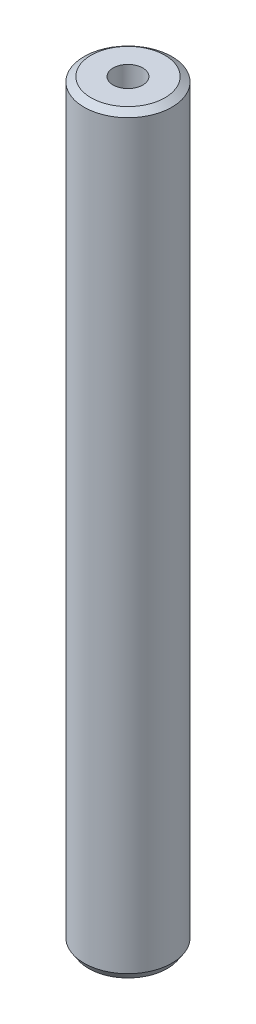
ISO-10303-21;
HEADER;
FILE_DESCRIPTION(('STEP AP214'),'2;1');
FILE_NAME('part.step','',(''),(''),'','','');
FILE_SCHEMA(('AUTOMOTIVE_DESIGN { 1 0 10303 214 1 1 1 1 }'));
ENDSEC;
DATA;
#1=APPLICATION_CONTEXT('core data for automotive mechanical design processes');
#2=APPLICATION_PROTOCOL_DEFINITION('international standard','automotive_design',2000,#1);
#3=PRODUCT_CONTEXT('',#1,'mechanical');
#4=PRODUCT('Part','Part','',(#3));
#5=PRODUCT_RELATED_PRODUCT_CATEGORY('part','',(#4));
#6=PRODUCT_DEFINITION_FORMATION('','',#4);
#7=PRODUCT_DEFINITION_CONTEXT('part definition',#1,'design');
#8=PRODUCT_DEFINITION('design','',#6,#7);
#9=PRODUCT_DEFINITION_SHAPE('','',#8);
#10=(LENGTH_UNIT() NAMED_UNIT(*) SI_UNIT(.MILLI.,.METRE.));
#11=(NAMED_UNIT(*) PLANE_ANGLE_UNIT() SI_UNIT($,.RADIAN.));
#12=(NAMED_UNIT(*) SI_UNIT($,.STERADIAN.) SOLID_ANGLE_UNIT());
#13=UNCERTAINTY_MEASURE_WITH_UNIT(LENGTH_MEASURE(1.E-05),#10,'distance_accuracy_value','');
#14=(GEOMETRIC_REPRESENTATION_CONTEXT(3) GLOBAL_UNCERTAINTY_ASSIGNED_CONTEXT((#13)) GLOBAL_UNIT_ASSIGNED_CONTEXT((#10,
#11,#12)) REPRESENTATION_CONTEXT('',''));
#15=CARTESIAN_POINT('',(0.,0.,0.));
#16=DIRECTION('',(0.,0.,1.));
#17=DIRECTION('',(1.,0.,0.));
#18=AXIS2_PLACEMENT_3D('',#15,#16,#17);
#19=CARTESIAN_POINT('',(0.,600.,0.));
#20=DIRECTION('',(0.,-1.,0.));
#21=DIRECTION('',(0.,0.,-1.));
#22=AXIS2_PLACEMENT_3D('',#19,#20,#21);
#23=CYLINDRICAL_SURFACE('',#22,35.);
#24=CARTESIAN_POINT('',(0.,596.298389018072,0.));
#25=DIRECTION('',(0.,1.,0.));
#26=DIRECTION('',(0.,0.,1.));
#27=AXIS2_PLACEMENT_3D('',#24,#25,#26);
#28=CIRCLE('',#27,35.);
#29=CARTESIAN_POINT('',(0.,596.298389018072,35.));
#30=VERTEX_POINT('',#29);
#31=EDGE_CURVE('E50',#30,#30,#28,.F.);
#32=ORIENTED_EDGE('',*,*,#31,.T.);
#33=EDGE_LOOP('',(#32));
#34=FACE_BOUND('',#33,.T.);
#35=CARTESIAN_POINT('',(0.,5.58968108519553,0.));
#36=DIRECTION('',(0.,1.,0.));
#37=DIRECTION('',(0.,0.,1.));
#38=AXIS2_PLACEMENT_3D('',#35,#36,#37);
#39=CIRCLE('',#38,35.);
#40=CARTESIAN_POINT('',(0.,5.58968108519553,35.));
#41=VERTEX_POINT('',#40);
#42=EDGE_CURVE('E51',#41,#41,#39,.T.);
#43=ORIENTED_EDGE('',*,*,#42,.T.);
#44=EDGE_LOOP('',(#43));
#45=FACE_BOUND('',#44,.T.);
#46=ADVANCED_FACE('F39',(#34,#45),#23,.T.);
#47=CARTESIAN_POINT('',(0.,600.,0.));
#48=DIRECTION('',(0.,1.,0.));
#49=DIRECTION('',(0.,0.,1.));
#50=AXIS2_PLACEMENT_3D('',#47,#48,#49);
#51=PLANE('',#50);
#52=CARTESIAN_POINT('',(0.,600.,0.));
#53=DIRECTION('',(0.,1.,0.));
#54=DIRECTION('',(0.,0.,1.));
#55=AXIS2_PLACEMENT_3D('',#52,#53,#54);
#56=CIRCLE('',#55,29.4103189148042);
#57=CARTESIAN_POINT('',(0.,600.,29.4103189148042));
#58=VERTEX_POINT('',#57);
#59=EDGE_CURVE('E54',#58,#58,#56,.T.);
#60=ORIENTED_EDGE('',*,*,#59,.T.);
#61=EDGE_LOOP('',(#60));
#62=FACE_BOUND('',#61,.T.);
#63=CARTESIAN_POINT('',(0.,600.,0.));
#64=DIRECTION('',(0.,1.,0.));
#65=DIRECTION('',(0.,0.,1.));
#66=AXIS2_PLACEMENT_3D('',#63,#64,#65);
#67=CIRCLE('',#66,11.8149842613026);
#68=CARTESIAN_POINT('',(0.,600.,11.8149842613026));
#69=VERTEX_POINT('',#68);
#70=EDGE_CURVE('E58',#69,#69,#67,.T.);
#71=ORIENTED_EDGE('',*,*,#70,.F.);
#72=EDGE_LOOP('',(#71));
#73=FACE_BOUND('',#72,.T.);
#74=ADVANCED_FACE('F69',(#62,#73),#51,.T.);
#75=CARTESIAN_POINT('',(0.,0.,0.));
#76=DIRECTION('',(0.,1.,0.));
#77=DIRECTION('',(0.,0.,1.));
#78=AXIS2_PLACEMENT_3D('',#75,#76,#77);
#79=PLANE('',#78);
#80=CARTESIAN_POINT('',(0.,0.,0.));
#81=DIRECTION('',(0.,1.,0.));
#82=DIRECTION('',(0.,0.,1.));
#83=AXIS2_PLACEMENT_3D('',#80,#81,#82);
#84=CIRCLE('',#83,31.2983890180721);
#85=CARTESIAN_POINT('',(0.,0.,31.2983890180721));
#86=VERTEX_POINT('',#85);
#87=EDGE_CURVE('E10',#86,#86,#84,.F.);
#88=ORIENTED_EDGE('',*,*,#87,.T.);
#89=EDGE_LOOP('',(#88));
#90=FACE_BOUND('',#89,.T.);
#91=CARTESIAN_POINT('',(0.,0.,0.));
#92=DIRECTION('',(0.,1.,0.));
#93=DIRECTION('',(0.,0.,1.));
#94=AXIS2_PLACEMENT_3D('',#91,#92,#93);
#95=CIRCLE('',#94,11.8149842613026);
#96=CARTESIAN_POINT('',(0.,0.,11.8149842613026));
#97=VERTEX_POINT('',#96);
#98=EDGE_CURVE('E63',#97,#97,#95,.T.);
#99=ORIENTED_EDGE('',*,*,#98,.T.);
#100=EDGE_LOOP('',(#99));
#101=FACE_BOUND('',#100,.T.);
#102=ADVANCED_FACE('F75',(#90,#101),#79,.F.);
#103=CARTESIAN_POINT('',(0.,600.,0.));
#104=DIRECTION('',(0.,-1.,0.));
#105=DIRECTION('',(0.,0.,-1.));
#106=AXIS2_PLACEMENT_3D('',#103,#104,#105);
#107=CYLINDRICAL_SURFACE('',#106,11.8149842613026);
#108=ORIENTED_EDGE('',*,*,#70,.T.);
#109=EDGE_LOOP('',(#108));
#110=FACE_BOUND('',#109,.T.);
#111=ORIENTED_EDGE('',*,*,#98,.F.);
#112=EDGE_LOOP('',(#111));
#113=FACE_BOUND('',#112,.T.);
#114=ADVANCED_FACE('F70',(#110,#113),#107,.F.);
#115=CARTESIAN_POINT('',(0.,600.,0.));
#116=DIRECTION('',(0.,-1.,0.));
#117=DIRECTION('',(0.,0.,-1.));
#118=AXIS2_PLACEMENT_3D('',#115,#116,#117);
#119=CONICAL_SURFACE('',#118,29.4103189148042,0.985876967112267);
#120=ORIENTED_EDGE('',*,*,#31,.F.);
#121=EDGE_LOOP('',(#120));
#122=FACE_BOUND('',#121,.T.);
#123=ORIENTED_EDGE('',*,*,#59,.F.);
#124=EDGE_LOOP('',(#123));
#125=FACE_BOUND('',#124,.T.);
#126=ADVANCED_FACE('F81',(#122,#125),#119,.T.);
#127=CARTESIAN_POINT('',(0.,5.58968108519553,0.));
#128=DIRECTION('',(0.,1.,0.));
#129=DIRECTION('',(0.,0.,1.));
#130=AXIS2_PLACEMENT_3D('',#127,#128,#129);
#131=CONICAL_SURFACE('',#130,35.,0.584919359682639);
#132=ORIENTED_EDGE('',*,*,#87,.F.);
#133=EDGE_LOOP('',(#132));
#134=FACE_BOUND('',#133,.T.);
#135=ORIENTED_EDGE('',*,*,#42,.F.);
#136=EDGE_LOOP('',(#135));
#137=FACE_BOUND('',#136,.T.);
#138=ADVANCED_FACE('F45',(#134,#137),#131,.T.);
#139=CLOSED_SHELL('',(#46,#74,#102,#114,#126,#138));
#140=MANIFOLD_SOLID_BREP('B2',#139);
#141=ADVANCED_BREP_SHAPE_REPRESENTATION('',(#18,#140),#14);
#142=SHAPE_DEFINITION_REPRESENTATION(#9,#141);
ENDSEC;
END-ISO-10303-21;
